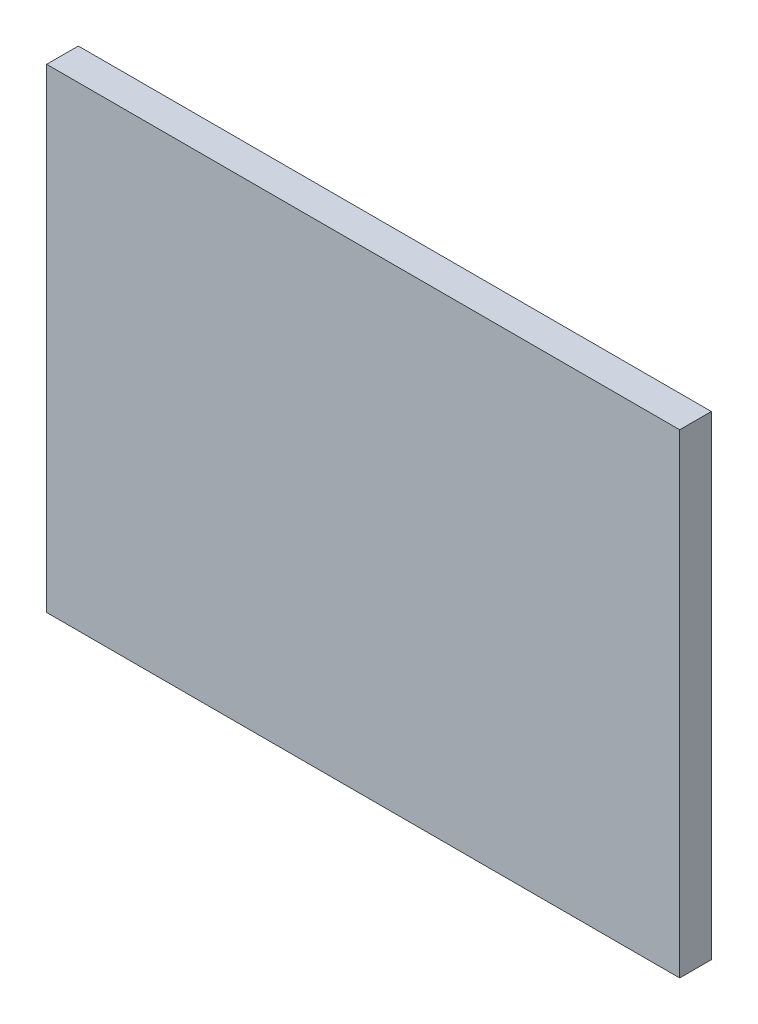
ISO-10303-21;
HEADER;
FILE_DESCRIPTION(('STEP AP214'),'2;1');
FILE_NAME('part.step','',(''),(''),'','','');
FILE_SCHEMA(('AUTOMOTIVE_DESIGN { 1 0 10303 214 1 1 1 1 }'));
ENDSEC;
DATA;
#1=APPLICATION_CONTEXT('core data for automotive mechanical design processes');
#2=APPLICATION_PROTOCOL_DEFINITION('international standard','automotive_design',2000,#1);
#3=PRODUCT_CONTEXT('',#1,'mechanical');
#4=PRODUCT('Part','Part','',(#3));
#5=PRODUCT_RELATED_PRODUCT_CATEGORY('part','',(#4));
#6=PRODUCT_DEFINITION_FORMATION('','',#4);
#7=PRODUCT_DEFINITION_CONTEXT('part definition',#1,'design');
#8=PRODUCT_DEFINITION('design','',#6,#7);
#9=PRODUCT_DEFINITION_SHAPE('','',#8);
#10=(LENGTH_UNIT() NAMED_UNIT(*) SI_UNIT(.MILLI.,.METRE.));
#11=(NAMED_UNIT(*) PLANE_ANGLE_UNIT() SI_UNIT($,.RADIAN.));
#12=(NAMED_UNIT(*) SI_UNIT($,.STERADIAN.) SOLID_ANGLE_UNIT());
#13=UNCERTAINTY_MEASURE_WITH_UNIT(LENGTH_MEASURE(1.E-05),#10,'distance_accuracy_value','');
#14=(GEOMETRIC_REPRESENTATION_CONTEXT(3) GLOBAL_UNCERTAINTY_ASSIGNED_CONTEXT((#13)) GLOBAL_UNIT_ASSIGNED_CONTEXT((#10,
#11,#12)) REPRESENTATION_CONTEXT('',''));
#15=CARTESIAN_POINT('',(0.,0.,0.));
#16=DIRECTION('',(0.,0.,1.));
#17=DIRECTION('',(1.,0.,0.));
#18=AXIS2_PLACEMENT_3D('',#15,#16,#17);
#19=CARTESIAN_POINT('',(10.,-7.5,1.));
#20=DIRECTION('',(-1.,0.,0.));
#21=DIRECTION('',(0.,0.,1.));
#22=AXIS2_PLACEMENT_3D('',#19,#20,#21);
#23=PLANE('',#22);
#24=DIRECTION('',(0.,1.,0.));
#25=VECTOR('',#24,1.);
#26=CARTESIAN_POINT('',(10.,-7.5,0.));
#27=LINE('',#26,#25);
#28=CARTESIAN_POINT('',(10.,-7.5,0.));
#29=VERTEX_POINT('',#28);
#30=CARTESIAN_POINT('',(10.,7.5,0.));
#31=VERTEX_POINT('',#30);
#32=EDGE_CURVE('E96',#29,#31,#27,.T.);
#33=ORIENTED_EDGE('',*,*,#32,.T.);
#34=DIRECTION('',(0.,0.,-1.));
#35=VECTOR('',#34,1.);
#36=CARTESIAN_POINT('',(10.,7.5,1.));
#37=LINE('',#36,#35);
#38=CARTESIAN_POINT('',(10.,7.5,1.));
#39=VERTEX_POINT('',#38);
#40=EDGE_CURVE('E11',#39,#31,#37,.T.);
#41=ORIENTED_EDGE('',*,*,#40,.F.);
#42=DIRECTION('',(0.,1.,0.));
#43=VECTOR('',#42,1.);
#44=CARTESIAN_POINT('',(10.,-7.5,1.));
#45=LINE('',#44,#43);
#46=CARTESIAN_POINT('',(10.,-7.5,1.));
#47=VERTEX_POINT('',#46);
#48=EDGE_CURVE('E84',#47,#39,#45,.T.);
#49=ORIENTED_EDGE('',*,*,#48,.F.);
#50=DIRECTION('',(0.,0.,-1.));
#51=VECTOR('',#50,1.);
#52=CARTESIAN_POINT('',(10.,-7.5,1.));
#53=LINE('',#52,#51);
#54=EDGE_CURVE('E92',#47,#29,#53,.T.);
#55=ORIENTED_EDGE('',*,*,#54,.T.);
#56=EDGE_LOOP('',(#33,#41,#49,#55));
#57=FACE_BOUND('',#56,.T.);
#58=ADVANCED_FACE('F33',(#57),#23,.F.);
#59=CARTESIAN_POINT('',(-10.,7.5,1.));
#60=DIRECTION('',(0.,-1.,0.));
#61=DIRECTION('',(0.,0.,-1.));
#62=AXIS2_PLACEMENT_3D('',#59,#60,#61);
#63=PLANE('',#62);
#64=DIRECTION('',(-1.,0.,0.));
#65=VECTOR('',#64,1.);
#66=CARTESIAN_POINT('',(-10.,7.5,0.));
#67=LINE('',#66,#65);
#68=CARTESIAN_POINT('',(-10.,7.5,0.));
#69=VERTEX_POINT('',#68);
#70=EDGE_CURVE('E88',#31,#69,#67,.T.);
#71=ORIENTED_EDGE('',*,*,#70,.T.);
#72=DIRECTION('',(0.,0.,-1.));
#73=VECTOR('',#72,1.);
#74=CARTESIAN_POINT('',(-10.,7.5,1.));
#75=LINE('',#74,#73);
#76=CARTESIAN_POINT('',(-10.,7.5,1.));
#77=VERTEX_POINT('',#76);
#78=EDGE_CURVE('E41',#77,#69,#75,.T.);
#79=ORIENTED_EDGE('',*,*,#78,.F.);
#80=DIRECTION('',(-1.,0.,0.));
#81=VECTOR('',#80,1.);
#82=CARTESIAN_POINT('',(-10.,7.5,1.));
#83=LINE('',#82,#81);
#84=EDGE_CURVE('E79',#39,#77,#83,.T.);
#85=ORIENTED_EDGE('',*,*,#84,.F.);
#86=ORIENTED_EDGE('',*,*,#40,.T.);
#87=EDGE_LOOP('',(#71,#79,#85,#86));
#88=FACE_BOUND('',#87,.T.);
#89=ADVANCED_FACE('F87',(#88),#63,.F.);
#90=CARTESIAN_POINT('',(-10.,-7.5,1.));
#91=DIRECTION('',(1.,0.,0.));
#92=DIRECTION('',(0.,0.,-1.));
#93=AXIS2_PLACEMENT_3D('',#90,#91,#92);
#94=PLANE('',#93);
#95=DIRECTION('',(0.,-1.,0.));
#96=VECTOR('',#95,1.);
#97=CARTESIAN_POINT('',(-10.,-7.5,0.));
#98=LINE('',#97,#96);
#99=CARTESIAN_POINT('',(-10.,-7.5,0.));
#100=VERTEX_POINT('',#99);
#101=EDGE_CURVE('E66',#69,#100,#98,.T.);
#102=ORIENTED_EDGE('',*,*,#101,.T.);
#103=DIRECTION('',(0.,0.,-1.));
#104=VECTOR('',#103,1.);
#105=CARTESIAN_POINT('',(-10.,-7.5,1.));
#106=LINE('',#105,#104);
#107=CARTESIAN_POINT('',(-10.,-7.5,1.));
#108=VERTEX_POINT('',#107);
#109=EDGE_CURVE('E89',#108,#100,#106,.T.);
#110=ORIENTED_EDGE('',*,*,#109,.F.);
#111=DIRECTION('',(0.,-1.,0.));
#112=VECTOR('',#111,1.);
#113=CARTESIAN_POINT('',(-10.,-7.5,1.));
#114=LINE('',#113,#112);
#115=EDGE_CURVE('E82',#77,#108,#114,.T.);
#116=ORIENTED_EDGE('',*,*,#115,.F.);
#117=ORIENTED_EDGE('',*,*,#78,.T.);
#118=EDGE_LOOP('',(#102,#110,#116,#117));
#119=FACE_BOUND('',#118,.T.);
#120=ADVANCED_FACE('F90',(#119),#94,.F.);
#121=CARTESIAN_POINT('',(-10.,-7.5,1.));
#122=DIRECTION('',(0.,1.,0.));
#123=DIRECTION('',(0.,0.,1.));
#124=AXIS2_PLACEMENT_3D('',#121,#122,#123);
#125=PLANE('',#124);
#126=DIRECTION('',(1.,0.,0.));
#127=VECTOR('',#126,1.);
#128=CARTESIAN_POINT('',(-10.,-7.5,0.));
#129=LINE('',#128,#127);
#130=EDGE_CURVE('E72',#100,#29,#129,.T.);
#131=ORIENTED_EDGE('',*,*,#130,.T.);
#132=ORIENTED_EDGE('',*,*,#54,.F.);
#133=DIRECTION('',(1.,0.,0.));
#134=VECTOR('',#133,1.);
#135=CARTESIAN_POINT('',(-10.,-7.5,1.));
#136=LINE('',#135,#134);
#137=EDGE_CURVE('E49',#108,#47,#136,.T.);
#138=ORIENTED_EDGE('',*,*,#137,.F.);
#139=ORIENTED_EDGE('',*,*,#109,.T.);
#140=EDGE_LOOP('',(#131,#132,#138,#139));
#141=FACE_BOUND('',#140,.T.);
#142=ADVANCED_FACE('F103',(#141),#125,.F.);
#143=CARTESIAN_POINT('',(0.,0.,1.));
#144=DIRECTION('',(0.,0.,-1.));
#145=DIRECTION('',(-1.,0.,0.));
#146=AXIS2_PLACEMENT_3D('',#143,#144,#145);
#147=PLANE('',#146);
#148=ORIENTED_EDGE('',*,*,#48,.T.);
#149=ORIENTED_EDGE('',*,*,#84,.T.);
#150=ORIENTED_EDGE('',*,*,#115,.T.);
#151=ORIENTED_EDGE('',*,*,#137,.T.);
#152=EDGE_LOOP('',(#148,#149,#150,#151));
#153=FACE_BOUND('',#152,.T.);
#154=ADVANCED_FACE('F80',(#153),#147,.F.);
#155=CARTESIAN_POINT('',(0.,0.,0.));
#156=DIRECTION('',(0.,0.,-1.));
#157=DIRECTION('',(-1.,0.,0.));
#158=AXIS2_PLACEMENT_3D('',#155,#156,#157);
#159=PLANE('',#158);
#160=ORIENTED_EDGE('',*,*,#32,.F.);
#161=ORIENTED_EDGE('',*,*,#130,.F.);
#162=ORIENTED_EDGE('',*,*,#101,.F.);
#163=ORIENTED_EDGE('',*,*,#70,.F.);
#164=EDGE_LOOP('',(#160,#161,#162,#163));
#165=FACE_BOUND('',#164,.T.);
#166=ADVANCED_FACE('F106',(#165),#159,.T.);
#167=CLOSED_SHELL('',(#58,#89,#120,#142,#154,#166));
#168=MANIFOLD_SOLID_BREP('B2',#167);
#169=ADVANCED_BREP_SHAPE_REPRESENTATION('',(#18,#168),#14);
#170=SHAPE_DEFINITION_REPRESENTATION(#9,#169);
ENDSEC;
END-ISO-10303-21;
